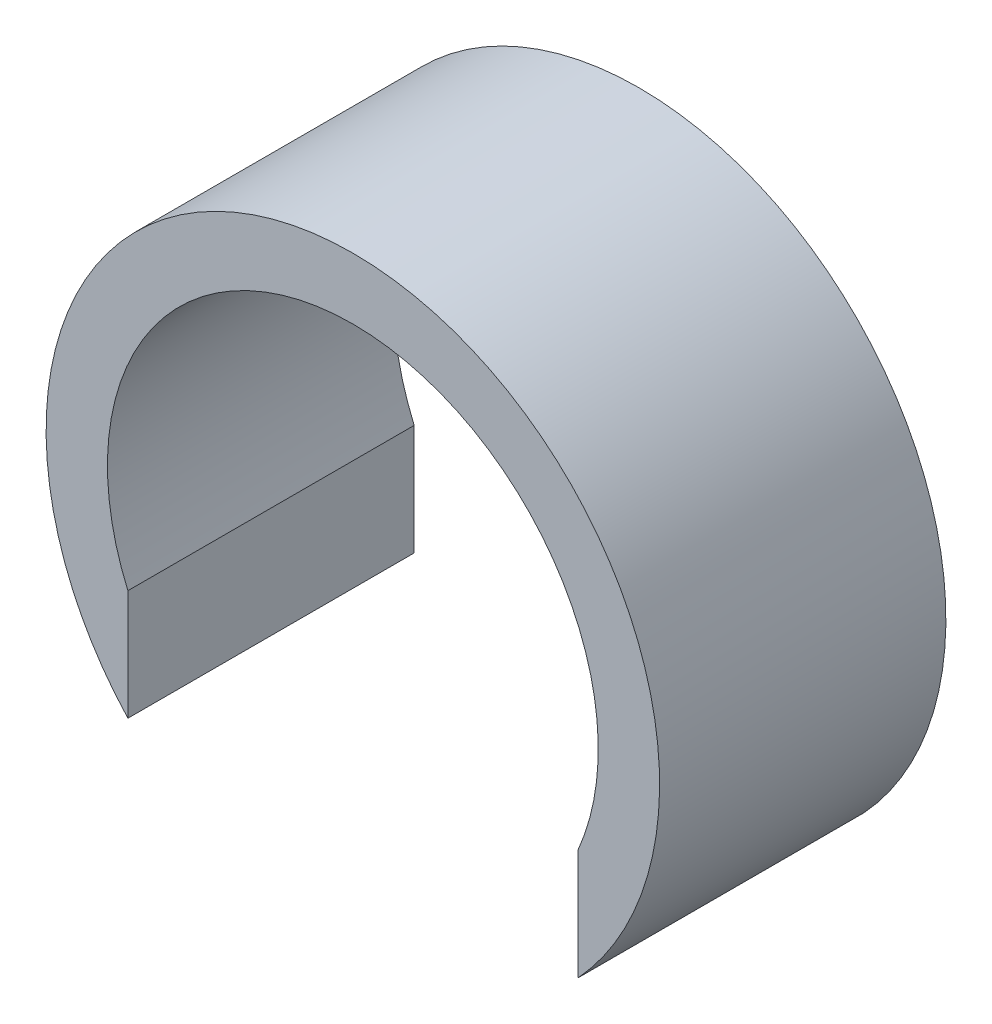
ISO-10303-21;
HEADER;
FILE_DESCRIPTION(('STEP AP214'),'2;1');
FILE_NAME('part.step','',(''),(''),'','','');
FILE_SCHEMA(('AUTOMOTIVE_DESIGN { 1 0 10303 214 1 1 1 1 }'));
ENDSEC;
DATA;
#1=APPLICATION_CONTEXT('core data for automotive mechanical design processes');
#2=APPLICATION_PROTOCOL_DEFINITION('international standard','automotive_design',2000,#1);
#3=PRODUCT_CONTEXT('',#1,'mechanical');
#4=PRODUCT('Part','Part','',(#3));
#5=PRODUCT_RELATED_PRODUCT_CATEGORY('part','',(#4));
#6=PRODUCT_DEFINITION_FORMATION('','',#4);
#7=PRODUCT_DEFINITION_CONTEXT('part definition',#1,'design');
#8=PRODUCT_DEFINITION('design','',#6,#7);
#9=PRODUCT_DEFINITION_SHAPE('','',#8);
#10=(LENGTH_UNIT() NAMED_UNIT(*) SI_UNIT(.MILLI.,.METRE.));
#11=(NAMED_UNIT(*) PLANE_ANGLE_UNIT() SI_UNIT($,.RADIAN.));
#12=(NAMED_UNIT(*) SI_UNIT($,.STERADIAN.) SOLID_ANGLE_UNIT());
#13=UNCERTAINTY_MEASURE_WITH_UNIT(LENGTH_MEASURE(1.E-05),#10,'distance_accuracy_value','');
#14=(GEOMETRIC_REPRESENTATION_CONTEXT(3) GLOBAL_UNCERTAINTY_ASSIGNED_CONTEXT((#13)) GLOBAL_UNIT_ASSIGNED_CONTEXT((#10,
#11,#12)) REPRESENTATION_CONTEXT('',''));
#15=CARTESIAN_POINT('',(0.,0.,0.));
#16=DIRECTION('',(0.,0.,1.));
#17=DIRECTION('',(1.,0.,0.));
#18=AXIS2_PLACEMENT_3D('',#15,#16,#17);
#19=CARTESIAN_POINT('',(0.,0.,7.));
#20=DIRECTION('',(0.,0.,-1.));
#21=DIRECTION('',(-1.,0.,0.));
#22=AXIS2_PLACEMENT_3D('',#19,#20,#21);
#23=CYLINDRICAL_SURFACE('',#22,6.);
#24=CARTESIAN_POINT('',(0.,0.,0.));
#25=DIRECTION('',(0.,0.,-1.));
#26=DIRECTION('',(1.,0.,0.));
#27=AXIS2_PLACEMENT_3D('',#24,#25,#26);
#28=CIRCLE('',#27,6.);
#29=CARTESIAN_POINT('',(-5.5,-2.39791576165636,0.));
#30=VERTEX_POINT('',#29);
#31=CARTESIAN_POINT('',(5.5,-2.39791576165636,0.));
#32=VERTEX_POINT('',#31);
#33=EDGE_CURVE('E94',#30,#32,#28,.T.);
#34=ORIENTED_EDGE('',*,*,#33,.T.);
#35=DIRECTION('',(0.,0.,-1.));
#36=VECTOR('',#35,1.);
#37=CARTESIAN_POINT('',(5.5,-2.39791576165636,7.));
#38=LINE('',#37,#36);
#39=CARTESIAN_POINT('',(5.5,-2.39791576165636,7.));
#40=VERTEX_POINT('',#39);
#41=EDGE_CURVE('E11',#40,#32,#38,.T.);
#42=ORIENTED_EDGE('',*,*,#41,.F.);
#43=CARTESIAN_POINT('',(0.,0.,7.));
#44=DIRECTION('',(0.,0.,-1.));
#45=DIRECTION('',(1.,0.,0.));
#46=AXIS2_PLACEMENT_3D('',#43,#44,#45);
#47=CIRCLE('',#46,6.);
#48=CARTESIAN_POINT('',(-5.5,-2.39791576165636,7.));
#49=VERTEX_POINT('',#48);
#50=EDGE_CURVE('E82',#49,#40,#47,.T.);
#51=ORIENTED_EDGE('',*,*,#50,.F.);
#52=DIRECTION('',(0.,0.,-1.));
#53=VECTOR('',#52,1.);
#54=CARTESIAN_POINT('',(-5.5,-2.39791576165636,7.));
#55=LINE('',#54,#53);
#56=EDGE_CURVE('E90',#49,#30,#55,.T.);
#57=ORIENTED_EDGE('',*,*,#56,.T.);
#58=EDGE_LOOP('',(#34,#42,#51,#57));
#59=FACE_BOUND('',#58,.T.);
#60=ADVANCED_FACE('F31',(#59),#23,.F.);
#61=CARTESIAN_POINT('',(5.5,-5.09901951359278,7.));
#62=DIRECTION('',(1.,0.,0.));
#63=DIRECTION('',(0.,1.,0.));
#64=AXIS2_PLACEMENT_3D('',#61,#62,#63);
#65=PLANE('',#64);
#66=DIRECTION('',(0.,-1.,0.));
#67=VECTOR('',#66,1.);
#68=CARTESIAN_POINT('',(5.5,-5.09901951359278,0.));
#69=LINE('',#68,#67);
#70=CARTESIAN_POINT('',(5.5,-5.09901951359278,0.));
#71=VERTEX_POINT('',#70);
#72=EDGE_CURVE('E86',#32,#71,#69,.T.);
#73=ORIENTED_EDGE('',*,*,#72,.T.);
#74=DIRECTION('',(0.,0.,-1.));
#75=VECTOR('',#74,1.);
#76=CARTESIAN_POINT('',(5.5,-5.09901951359278,7.));
#77=LINE('',#76,#75);
#78=CARTESIAN_POINT('',(5.5,-5.09901951359278,7.));
#79=VERTEX_POINT('',#78);
#80=EDGE_CURVE('E39',#79,#71,#77,.T.);
#81=ORIENTED_EDGE('',*,*,#80,.F.);
#82=DIRECTION('',(0.,-1.,0.));
#83=VECTOR('',#82,1.);
#84=CARTESIAN_POINT('',(5.5,-5.09901951359278,7.));
#85=LINE('',#84,#83);
#86=EDGE_CURVE('E77',#40,#79,#85,.T.);
#87=ORIENTED_EDGE('',*,*,#86,.F.);
#88=ORIENTED_EDGE('',*,*,#41,.T.);
#89=EDGE_LOOP('',(#73,#81,#87,#88));
#90=FACE_BOUND('',#89,.T.);
#91=ADVANCED_FACE('F85',(#90),#65,.F.);
#92=CARTESIAN_POINT('',(0.,0.,7.));
#93=DIRECTION('',(0.,0.,-1.));
#94=DIRECTION('',(-1.,0.,0.));
#95=AXIS2_PLACEMENT_3D('',#92,#93,#94);
#96=CYLINDRICAL_SURFACE('',#95,7.5);
#97=CARTESIAN_POINT('',(0.,0.,0.));
#98=DIRECTION('',(0.,0.,1.));
#99=DIRECTION('',(1.,0.,0.));
#100=AXIS2_PLACEMENT_3D('',#97,#98,#99);
#101=CIRCLE('',#100,7.5);
#102=CARTESIAN_POINT('',(-5.5,-5.09901951359278,0.));
#103=VERTEX_POINT('',#102);
#104=EDGE_CURVE('E64',#71,#103,#101,.T.);
#105=ORIENTED_EDGE('',*,*,#104,.T.);
#106=DIRECTION('',(0.,0.,-1.));
#107=VECTOR('',#106,1.);
#108=CARTESIAN_POINT('',(-5.5,-5.09901951359278,7.));
#109=LINE('',#108,#107);
#110=CARTESIAN_POINT('',(-5.5,-5.09901951359278,7.));
#111=VERTEX_POINT('',#110);
#112=EDGE_CURVE('E87',#111,#103,#109,.T.);
#113=ORIENTED_EDGE('',*,*,#112,.F.);
#114=CARTESIAN_POINT('',(0.,0.,7.));
#115=DIRECTION('',(0.,0.,1.));
#116=DIRECTION('',(1.,0.,0.));
#117=AXIS2_PLACEMENT_3D('',#114,#115,#116);
#118=CIRCLE('',#117,7.5);
#119=EDGE_CURVE('E80',#79,#111,#118,.T.);
#120=ORIENTED_EDGE('',*,*,#119,.F.);
#121=ORIENTED_EDGE('',*,*,#80,.T.);
#122=EDGE_LOOP('',(#105,#113,#120,#121));
#123=FACE_BOUND('',#122,.T.);
#124=ADVANCED_FACE('F88',(#123),#96,.T.);
#125=CARTESIAN_POINT('',(-5.5,-5.09901951359279,7.));
#126=DIRECTION('',(-1.,0.,0.));
#127=DIRECTION('',(0.,0.,1.));
#128=AXIS2_PLACEMENT_3D('',#125,#126,#127);
#129=PLANE('',#128);
#130=DIRECTION('',(0.,1.,0.));
#131=VECTOR('',#130,1.);
#132=CARTESIAN_POINT('',(-5.5,-5.09901951359279,0.));
#133=LINE('',#132,#131);
#134=EDGE_CURVE('E70',#103,#30,#133,.T.);
#135=ORIENTED_EDGE('',*,*,#134,.T.);
#136=ORIENTED_EDGE('',*,*,#56,.F.);
#137=DIRECTION('',(0.,1.,0.));
#138=VECTOR('',#137,1.);
#139=CARTESIAN_POINT('',(-5.5,-5.09901951359279,7.));
#140=LINE('',#139,#138);
#141=EDGE_CURVE('E47',#111,#49,#140,.T.);
#142=ORIENTED_EDGE('',*,*,#141,.F.);
#143=ORIENTED_EDGE('',*,*,#112,.T.);
#144=EDGE_LOOP('',(#135,#136,#142,#143));
#145=FACE_BOUND('',#144,.T.);
#146=ADVANCED_FACE('F101',(#145),#129,.F.);
#147=CARTESIAN_POINT('',(0.,0.,7.));
#148=DIRECTION('',(0.,0.,1.));
#149=DIRECTION('',(1.,0.,0.));
#150=AXIS2_PLACEMENT_3D('',#147,#148,#149);
#151=PLANE('',#150);
#152=ORIENTED_EDGE('',*,*,#50,.T.);
#153=ORIENTED_EDGE('',*,*,#86,.T.);
#154=ORIENTED_EDGE('',*,*,#119,.T.);
#155=ORIENTED_EDGE('',*,*,#141,.T.);
#156=EDGE_LOOP('',(#152,#153,#154,#155));
#157=FACE_BOUND('',#156,.T.);
#158=ADVANCED_FACE('F78',(#157),#151,.T.);
#159=CARTESIAN_POINT('',(0.,0.,0.));
#160=DIRECTION('',(0.,0.,1.));
#161=DIRECTION('',(1.,0.,0.));
#162=AXIS2_PLACEMENT_3D('',#159,#160,#161);
#163=PLANE('',#162);
#164=ORIENTED_EDGE('',*,*,#33,.F.);
#165=ORIENTED_EDGE('',*,*,#134,.F.);
#166=ORIENTED_EDGE('',*,*,#104,.F.);
#167=ORIENTED_EDGE('',*,*,#72,.F.);
#168=EDGE_LOOP('',(#164,#165,#166,#167));
#169=FACE_BOUND('',#168,.T.);
#170=ADVANCED_FACE('F104',(#169),#163,.F.);
#171=CLOSED_SHELL('',(#60,#91,#124,#146,#158,#170));
#172=MANIFOLD_SOLID_BREP('B2',#171);
#173=ADVANCED_BREP_SHAPE_REPRESENTATION('',(#18,#172),#14);
#174=SHAPE_DEFINITION_REPRESENTATION(#9,#173);
ENDSEC;
END-ISO-10303-21;
